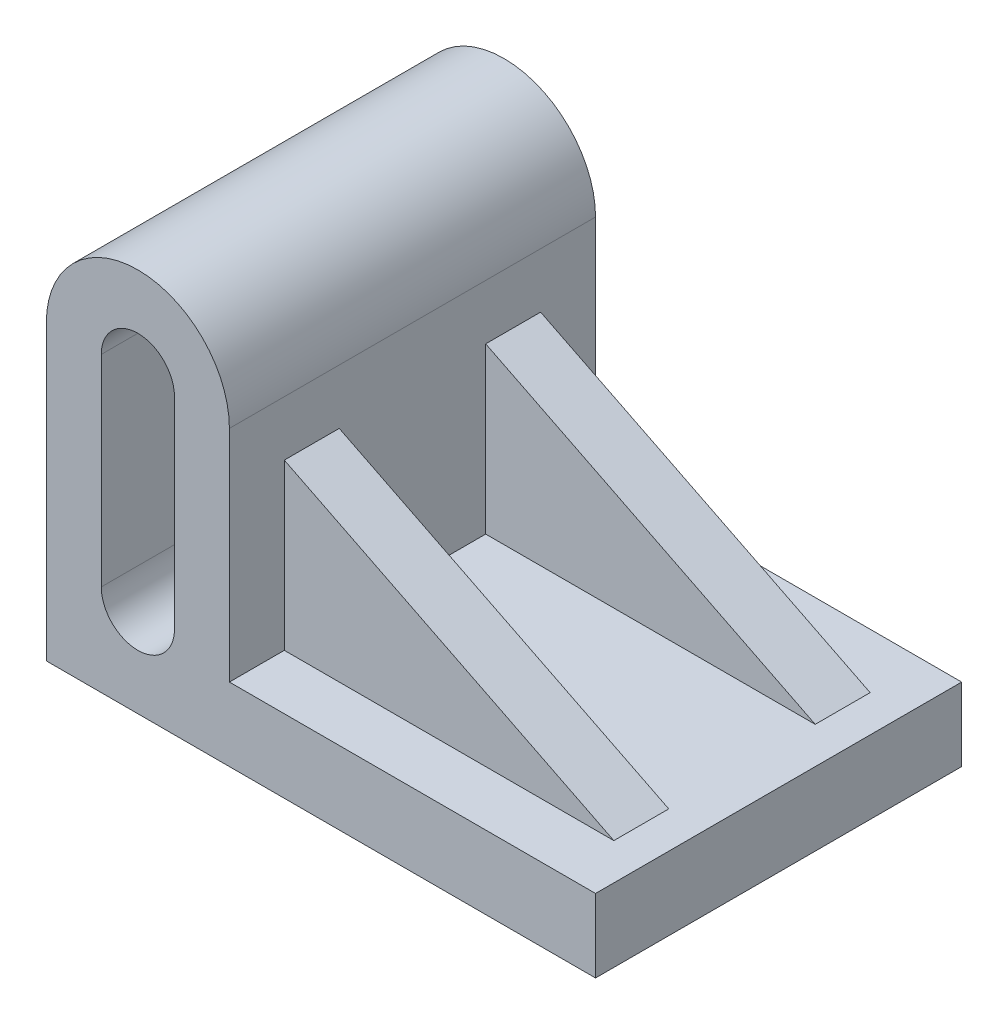
ISO-10303-21;
HEADER;
FILE_DESCRIPTION(('STEP AP214'),'2;1');
FILE_NAME('part.step','',(''),(''),'','','');
FILE_SCHEMA(('AUTOMOTIVE_DESIGN { 1 0 10303 214 1 1 1 1 }'));
ENDSEC;
DATA;
#1=APPLICATION_CONTEXT('core data for automotive mechanical design processes');
#2=APPLICATION_PROTOCOL_DEFINITION('international standard','automotive_design',2000,#1);
#3=PRODUCT_CONTEXT('',#1,'mechanical');
#4=PRODUCT('Part','Part','',(#3));
#5=PRODUCT_RELATED_PRODUCT_CATEGORY('part','',(#4));
#6=PRODUCT_DEFINITION_FORMATION('','',#4);
#7=PRODUCT_DEFINITION_CONTEXT('part definition',#1,'design');
#8=PRODUCT_DEFINITION('design','',#6,#7);
#9=PRODUCT_DEFINITION_SHAPE('','',#8);
#10=(LENGTH_UNIT() NAMED_UNIT(*) SI_UNIT(.MILLI.,.METRE.));
#11=(NAMED_UNIT(*) PLANE_ANGLE_UNIT() SI_UNIT($,.RADIAN.));
#12=(NAMED_UNIT(*) SI_UNIT($,.STERADIAN.) SOLID_ANGLE_UNIT());
#13=UNCERTAINTY_MEASURE_WITH_UNIT(LENGTH_MEASURE(1.E-05),#10,'distance_accuracy_value','');
#14=(GEOMETRIC_REPRESENTATION_CONTEXT(3) GLOBAL_UNCERTAINTY_ASSIGNED_CONTEXT((#13)) GLOBAL_UNIT_ASSIGNED_CONTEXT((#10,
#11,#12)) REPRESENTATION_CONTEXT('',''));
#15=CARTESIAN_POINT('',(0.,0.,0.));
#16=DIRECTION('',(0.,0.,1.));
#17=DIRECTION('',(1.,0.,0.));
#18=AXIS2_PLACEMENT_3D('',#15,#16,#17);
#19=CARTESIAN_POINT('',(0.,-20.,100.));
#20=DIRECTION('',(0.,1.,0.));
#21=DIRECTION('',(0.,0.,1.));
#22=AXIS2_PLACEMENT_3D('',#19,#20,#21);
#23=PLANE('',#22);
#24=DIRECTION('',(1.,0.,0.));
#25=VECTOR('',#24,1.);
#26=CARTESIAN_POINT('',(0.,-20.,70.));
#27=LINE('',#26,#25);
#28=CARTESIAN_POINT('',(-25.,-20.,70.));
#29=VERTEX_POINT('',#28);
#30=CARTESIAN_POINT('',(65.,-20.,70.));
#31=VERTEX_POINT('',#30);
#32=EDGE_CURVE('E355',#29,#31,#27,.T.);
#33=ORIENTED_EDGE('',*,*,#32,.T.);
#34=DIRECTION('',(0.,0.,1.));
#35=VECTOR('',#34,1.);
#36=CARTESIAN_POINT('',(65.,-20.,0.));
#37=LINE('',#36,#35);
#38=CARTESIAN_POINT('',(65.,-20.,85.));
#39=VERTEX_POINT('',#38);
#40=EDGE_CURVE('E173',#31,#39,#37,.T.);
#41=ORIENTED_EDGE('',*,*,#40,.T.);
#42=DIRECTION('',(1.,0.,0.));
#43=VECTOR('',#42,1.);
#44=CARTESIAN_POINT('',(0.,-20.,85.));
#45=LINE('',#44,#43);
#46=CARTESIAN_POINT('',(-25.,-20.,85.));
#47=VERTEX_POINT('',#46);
#48=EDGE_CURVE('E179',#47,#39,#45,.T.);
#49=ORIENTED_EDGE('',*,*,#48,.F.);
#50=DIRECTION('',(0.,0.,-1.));
#51=VECTOR('',#50,1.);
#52=CARTESIAN_POINT('',(-25.,-20.,100.));
#53=LINE('',#52,#51);
#54=CARTESIAN_POINT('',(-25.,-20.,100.));
#55=VERTEX_POINT('',#54);
#56=EDGE_CURVE('E11',#55,#47,#53,.T.);
#57=ORIENTED_EDGE('',*,*,#56,.F.);
#58=DIRECTION('',(1.,0.,0.));
#59=VECTOR('',#58,1.);
#60=CARTESIAN_POINT('',(0.,-20.,100.));
#61=LINE('',#60,#59);
#62=CARTESIAN_POINT('',(75.,-20.,100.));
#63=VERTEX_POINT('',#62);
#64=EDGE_CURVE('E209',#55,#63,#61,.T.);
#65=ORIENTED_EDGE('',*,*,#64,.T.);
#66=DIRECTION('',(0.,0.,-1.));
#67=VECTOR('',#66,1.);
#68=CARTESIAN_POINT('',(75.,-20.,100.));
#69=LINE('',#68,#67);
#70=CARTESIAN_POINT('',(75.,-20.,0.));
#71=VERTEX_POINT('',#70);
#72=EDGE_CURVE('E268',#63,#71,#69,.T.);
#73=ORIENTED_EDGE('',*,*,#72,.T.);
#74=DIRECTION('',(1.,0.,0.));
#75=VECTOR('',#74,1.);
#76=CARTESIAN_POINT('',(0.,-20.,0.));
#77=LINE('',#76,#75);
#78=CARTESIAN_POINT('',(-25.,-20.,0.));
#79=VERTEX_POINT('',#78);
#80=EDGE_CURVE('E247',#79,#71,#77,.T.);
#81=ORIENTED_EDGE('',*,*,#80,.F.);
#82=CARTESIAN_POINT('',(-25.,-20.,15.));
#83=VERTEX_POINT('',#82);
#84=EDGE_CURVE('E57',#83,#79,#53,.T.);
#85=ORIENTED_EDGE('',*,*,#84,.F.);
#86=DIRECTION('',(1.,0.,0.));
#87=VECTOR('',#86,1.);
#88=CARTESIAN_POINT('',(0.,-20.,15.));
#89=LINE('',#88,#87);
#90=CARTESIAN_POINT('',(65.,-20.,15.));
#91=VERTEX_POINT('',#90);
#92=EDGE_CURVE('E377',#83,#91,#89,.T.);
#93=ORIENTED_EDGE('',*,*,#92,.T.);
#94=DIRECTION('',(0.,0.,1.));
#95=VECTOR('',#94,1.);
#96=CARTESIAN_POINT('',(65.,-20.,0.));
#97=LINE('',#96,#95);
#98=CARTESIAN_POINT('',(65.,-20.,30.));
#99=VERTEX_POINT('',#98);
#100=EDGE_CURVE('E371',#91,#99,#97,.T.);
#101=ORIENTED_EDGE('',*,*,#100,.T.);
#102=DIRECTION('',(1.,0.,0.));
#103=VECTOR('',#102,1.);
#104=CARTESIAN_POINT('',(0.,-20.,30.));
#105=LINE('',#104,#103);
#106=CARTESIAN_POINT('',(-25.,-20.,30.));
#107=VERTEX_POINT('',#106);
#108=EDGE_CURVE('E352',#107,#99,#105,.T.);
#109=ORIENTED_EDGE('',*,*,#108,.F.);
#110=EDGE_CURVE('E55',#29,#107,#53,.T.);
#111=ORIENTED_EDGE('',*,*,#110,.F.);
#112=EDGE_LOOP('',(#33,#41,#49,#57,#65,#73,#81,#85,#93,#101,#109,#111));
#113=FACE_BOUND('',#112,.T.);
#114=ADVANCED_FACE('F45',(#113),#23,.T.);
#115=CARTESIAN_POINT('',(-25.,0.,100.));
#116=DIRECTION('',(1.,0.,0.));
#117=DIRECTION('',(0.,0.,-1.));
#118=AXIS2_PLACEMENT_3D('',#115,#116,#117);
#119=PLANE('',#118);
#120=ORIENTED_EDGE('',*,*,#84,.T.);
#121=DIRECTION('',(0.,-1.,0.));
#122=VECTOR('',#121,1.);
#123=CARTESIAN_POINT('',(-25.,0.,0.));
#124=LINE('',#123,#122);
#125=CARTESIAN_POINT('',(-25.,40.,0.));
#126=VERTEX_POINT('',#125);
#127=EDGE_CURVE('E250',#126,#79,#124,.T.);
#128=ORIENTED_EDGE('',*,*,#127,.F.);
#129=DIRECTION('',(0.,0.,-1.));
#130=VECTOR('',#129,1.);
#131=CARTESIAN_POINT('',(-25.,40.,100.));
#132=LINE('',#131,#130);
#133=CARTESIAN_POINT('',(-25.,40.,100.));
#134=VERTEX_POINT('',#133);
#135=EDGE_CURVE('E283',#134,#126,#132,.T.);
#136=ORIENTED_EDGE('',*,*,#135,.F.);
#137=DIRECTION('',(0.,-1.,0.));
#138=VECTOR('',#137,1.);
#139=CARTESIAN_POINT('',(-25.,0.,100.));
#140=LINE('',#139,#138);
#141=EDGE_CURVE('E213',#134,#55,#140,.T.);
#142=ORIENTED_EDGE('',*,*,#141,.T.);
#143=ORIENTED_EDGE('',*,*,#56,.T.);
#144=DIRECTION('',(0.,-1.,0.));
#145=VECTOR('',#144,1.);
#146=CARTESIAN_POINT('',(-25.,25.,85.));
#147=LINE('',#146,#145);
#148=CARTESIAN_POINT('',(-25.,25.,85.));
#149=VERTEX_POINT('',#148);
#150=EDGE_CURVE('E172',#149,#47,#147,.T.);
#151=ORIENTED_EDGE('',*,*,#150,.F.);
#152=DIRECTION('',(0.,0.,1.));
#153=VECTOR('',#152,1.);
#154=CARTESIAN_POINT('',(-25.,25.,0.));
#155=LINE('',#154,#153);
#156=CARTESIAN_POINT('',(-25.,25.,70.));
#157=VERTEX_POINT('',#156);
#158=EDGE_CURVE('E162',#157,#149,#155,.T.);
#159=ORIENTED_EDGE('',*,*,#158,.F.);
#160=DIRECTION('',(0.,-1.,0.));
#161=VECTOR('',#160,1.);
#162=CARTESIAN_POINT('',(-25.,25.,70.));
#163=LINE('',#162,#161);
#164=EDGE_CURVE('E185',#157,#29,#163,.T.);
#165=ORIENTED_EDGE('',*,*,#164,.T.);
#166=ORIENTED_EDGE('',*,*,#110,.T.);
#167=DIRECTION('',(0.,-1.,0.));
#168=VECTOR('',#167,1.);
#169=CARTESIAN_POINT('',(-25.,25.,30.));
#170=LINE('',#169,#168);
#171=CARTESIAN_POINT('',(-25.,25.,30.));
#172=VERTEX_POINT('',#171);
#173=EDGE_CURVE('E346',#172,#107,#170,.T.);
#174=ORIENTED_EDGE('',*,*,#173,.F.);
#175=DIRECTION('',(0.,0.,1.));
#176=VECTOR('',#175,1.);
#177=CARTESIAN_POINT('',(-25.,25.,0.));
#178=LINE('',#177,#176);
#179=CARTESIAN_POINT('',(-25.,25.,15.));
#180=VERTEX_POINT('',#179);
#181=EDGE_CURVE('E360',#180,#172,#178,.T.);
#182=ORIENTED_EDGE('',*,*,#181,.F.);
#183=DIRECTION('',(0.,-1.,0.));
#184=VECTOR('',#183,1.);
#185=CARTESIAN_POINT('',(-25.,25.,15.));
#186=LINE('',#185,#184);
#187=EDGE_CURVE('E71',#180,#83,#186,.T.);
#188=ORIENTED_EDGE('',*,*,#187,.T.);
#189=EDGE_LOOP('',(#120,#128,#136,#142,#143,#151,#159,#165,#166,#174,#182,#188));
#190=FACE_BOUND('',#189,.T.);
#191=ADVANCED_FACE('F182',(#190),#119,.T.);
#192=CARTESIAN_POINT('',(-50.,40.,100.));
#193=DIRECTION('',(0.,0.,-1.));
#194=DIRECTION('',(-1.,0.,0.));
#195=AXIS2_PLACEMENT_3D('',#192,#193,#194);
#196=CYLINDRICAL_SURFACE('',#195,25.);
#197=CARTESIAN_POINT('',(-50.,40.,0.));
#198=DIRECTION('',(0.,0.,1.));
#199=DIRECTION('',(1.,0.,0.));
#200=AXIS2_PLACEMENT_3D('',#197,#198,#199);
#201=CIRCLE('',#200,25.);
#202=CARTESIAN_POINT('',(-75.,40.,0.));
#203=VERTEX_POINT('',#202);
#204=EDGE_CURVE('E253',#126,#203,#201,.T.);
#205=ORIENTED_EDGE('',*,*,#204,.T.);
#206=DIRECTION('',(0.,0.,-1.));
#207=VECTOR('',#206,1.);
#208=CARTESIAN_POINT('',(-75.,40.,100.));
#209=LINE('',#208,#207);
#210=CARTESIAN_POINT('',(-75.,40.,100.));
#211=VERTEX_POINT('',#210);
#212=EDGE_CURVE('E279',#211,#203,#209,.T.);
#213=ORIENTED_EDGE('',*,*,#212,.F.);
#214=CARTESIAN_POINT('',(-50.,40.,100.));
#215=DIRECTION('',(0.,0.,1.));
#216=DIRECTION('',(1.,0.,0.));
#217=AXIS2_PLACEMENT_3D('',#214,#215,#216);
#218=CIRCLE('',#217,25.);
#219=EDGE_CURVE('E216',#134,#211,#218,.T.);
#220=ORIENTED_EDGE('',*,*,#219,.F.);
#221=ORIENTED_EDGE('',*,*,#135,.T.);
#222=EDGE_LOOP('',(#205,#213,#220,#221));
#223=FACE_BOUND('',#222,.T.);
#224=ADVANCED_FACE('F327',(#223),#196,.T.);
#225=CARTESIAN_POINT('',(-75.,0.,100.));
#226=DIRECTION('',(1.,0.,0.));
#227=DIRECTION('',(0.,1.,0.));
#228=AXIS2_PLACEMENT_3D('',#225,#226,#227);
#229=PLANE('',#228);
#230=DIRECTION('',(0.,-1.,0.));
#231=VECTOR('',#230,1.);
#232=CARTESIAN_POINT('',(-75.,0.,0.));
#233=LINE('',#232,#231);
#234=CARTESIAN_POINT('',(-75.,-40.,0.));
#235=VERTEX_POINT('',#234);
#236=EDGE_CURVE('E257',#203,#235,#233,.T.);
#237=ORIENTED_EDGE('',*,*,#236,.T.);
#238=DIRECTION('',(0.,0.,-1.));
#239=VECTOR('',#238,1.);
#240=CARTESIAN_POINT('',(-75.,-40.,100.));
#241=LINE('',#240,#239);
#242=CARTESIAN_POINT('',(-75.,-40.,100.));
#243=VERTEX_POINT('',#242);
#244=EDGE_CURVE('E275',#243,#235,#241,.T.);
#245=ORIENTED_EDGE('',*,*,#244,.F.);
#246=DIRECTION('',(0.,-1.,0.));
#247=VECTOR('',#246,1.);
#248=CARTESIAN_POINT('',(-75.,0.,100.));
#249=LINE('',#248,#247);
#250=EDGE_CURVE('E220',#211,#243,#249,.T.);
#251=ORIENTED_EDGE('',*,*,#250,.F.);
#252=ORIENTED_EDGE('',*,*,#212,.T.);
#253=EDGE_LOOP('',(#237,#245,#251,#252));
#254=FACE_BOUND('',#253,.T.);
#255=ADVANCED_FACE('F331',(#254),#229,.F.);
#256=CARTESIAN_POINT('',(0.,-40.,100.));
#257=DIRECTION('',(0.,1.,0.));
#258=DIRECTION('',(0.,0.,1.));
#259=AXIS2_PLACEMENT_3D('',#256,#257,#258);
#260=PLANE('',#259);
#261=DIRECTION('',(1.,0.,0.));
#262=VECTOR('',#261,1.);
#263=CARTESIAN_POINT('',(0.,-40.,0.));
#264=LINE('',#263,#262);
#265=CARTESIAN_POINT('',(75.,-40.,0.));
#266=VERTEX_POINT('',#265);
#267=EDGE_CURVE('E261',#235,#266,#264,.T.);
#268=ORIENTED_EDGE('',*,*,#267,.T.);
#269=DIRECTION('',(0.,0.,-1.));
#270=VECTOR('',#269,1.);
#271=CARTESIAN_POINT('',(75.,-40.,100.));
#272=LINE('',#271,#270);
#273=CARTESIAN_POINT('',(75.,-40.,100.));
#274=VERTEX_POINT('',#273);
#275=EDGE_CURVE('E272',#274,#266,#272,.T.);
#276=ORIENTED_EDGE('',*,*,#275,.F.);
#277=DIRECTION('',(1.,0.,0.));
#278=VECTOR('',#277,1.);
#279=CARTESIAN_POINT('',(0.,-40.,100.));
#280=LINE('',#279,#278);
#281=EDGE_CURVE('E224',#243,#274,#280,.T.);
#282=ORIENTED_EDGE('',*,*,#281,.F.);
#283=ORIENTED_EDGE('',*,*,#244,.T.);
#284=EDGE_LOOP('',(#268,#276,#282,#283));
#285=FACE_BOUND('',#284,.T.);
#286=ADVANCED_FACE('F333',(#285),#260,.F.);
#287=CARTESIAN_POINT('',(-60.,0.,100.));
#288=DIRECTION('',(1.,0.,0.));
#289=DIRECTION('',(0.,0.,-1.));
#290=AXIS2_PLACEMENT_3D('',#287,#288,#289);
#291=PLANE('',#290);
#292=DIRECTION('',(0.,-1.,0.));
#293=VECTOR('',#292,1.);
#294=CARTESIAN_POINT('',(-60.,0.,0.));
#295=LINE('',#294,#293);
#296=CARTESIAN_POINT('',(-60.,40.,0.));
#297=VERTEX_POINT('',#296);
#298=CARTESIAN_POINT('',(-60.,-15.,0.));
#299=VERTEX_POINT('',#298);
#300=EDGE_CURVE('E188',#297,#299,#295,.T.);
#301=ORIENTED_EDGE('',*,*,#300,.F.);
#302=DIRECTION('',(0.,0.,-1.));
#303=VECTOR('',#302,1.);
#304=CARTESIAN_POINT('',(-60.,40.,100.));
#305=LINE('',#304,#303);
#306=CARTESIAN_POINT('',(-60.,40.,100.));
#307=VERTEX_POINT('',#306);
#308=EDGE_CURVE('E49',#307,#297,#305,.T.);
#309=ORIENTED_EDGE('',*,*,#308,.F.);
#310=DIRECTION('',(0.,-1.,0.));
#311=VECTOR('',#310,1.);
#312=CARTESIAN_POINT('',(-60.,0.,100.));
#313=LINE('',#312,#311);
#314=CARTESIAN_POINT('',(-60.,-15.,100.));
#315=VERTEX_POINT('',#314);
#316=EDGE_CURVE('E193',#307,#315,#313,.T.);
#317=ORIENTED_EDGE('',*,*,#316,.T.);
#318=DIRECTION('',(0.,0.,-1.));
#319=VECTOR('',#318,1.);
#320=CARTESIAN_POINT('',(-60.,-15.,100.));
#321=LINE('',#320,#319);
#322=EDGE_CURVE('E231',#315,#299,#321,.T.);
#323=ORIENTED_EDGE('',*,*,#322,.T.);
#324=EDGE_LOOP('',(#301,#309,#317,#323));
#325=FACE_BOUND('',#324,.T.);
#326=ADVANCED_FACE('F47',(#325),#291,.T.);
#327=CARTESIAN_POINT('',(-50.,40.,100.));
#328=DIRECTION('',(0.,0.,-1.));
#329=DIRECTION('',(-1.,0.,0.));
#330=AXIS2_PLACEMENT_3D('',#327,#328,#329);
#331=CYLINDRICAL_SURFACE('',#330,10.);
#332=CARTESIAN_POINT('',(-50.,40.,0.));
#333=DIRECTION('',(0.,0.,1.));
#334=DIRECTION('',(1.,0.,0.));
#335=AXIS2_PLACEMENT_3D('',#332,#333,#334);
#336=CIRCLE('',#335,10.);
#337=CARTESIAN_POINT('',(-40.,40.,0.));
#338=VERTEX_POINT('',#337);
#339=EDGE_CURVE('E235',#338,#297,#336,.T.);
#340=ORIENTED_EDGE('',*,*,#339,.F.);
#341=DIRECTION('',(0.,0.,-1.));
#342=VECTOR('',#341,1.);
#343=CARTESIAN_POINT('',(-40.,40.,100.));
#344=LINE('',#343,#342);
#345=CARTESIAN_POINT('',(-40.,40.,100.));
#346=VERTEX_POINT('',#345);
#347=EDGE_CURVE('E290',#346,#338,#344,.T.);
#348=ORIENTED_EDGE('',*,*,#347,.F.);
#349=CARTESIAN_POINT('',(-50.,40.,100.));
#350=DIRECTION('',(0.,0.,1.));
#351=DIRECTION('',(1.,0.,0.));
#352=AXIS2_PLACEMENT_3D('',#349,#350,#351);
#353=CIRCLE('',#352,10.);
#354=EDGE_CURVE('E197',#346,#307,#353,.T.);
#355=ORIENTED_EDGE('',*,*,#354,.T.);
#356=ORIENTED_EDGE('',*,*,#308,.T.);
#357=EDGE_LOOP('',(#340,#348,#355,#356));
#358=FACE_BOUND('',#357,.T.);
#359=ADVANCED_FACE('F299',(#358),#331,.F.);
#360=CARTESIAN_POINT('',(-40.,0.,100.));
#361=DIRECTION('',(1.,0.,0.));
#362=DIRECTION('',(0.,1.,0.));
#363=AXIS2_PLACEMENT_3D('',#360,#361,#362);
#364=PLANE('',#363);
#365=DIRECTION('',(0.,-1.,0.));
#366=VECTOR('',#365,1.);
#367=CARTESIAN_POINT('',(-40.,0.,0.));
#368=LINE('',#367,#366);
#369=CARTESIAN_POINT('',(-40.,-15.,0.));
#370=VERTEX_POINT('',#369);
#371=EDGE_CURVE('E239',#338,#370,#368,.T.);
#372=ORIENTED_EDGE('',*,*,#371,.T.);
#373=DIRECTION('',(0.,0.,-1.));
#374=VECTOR('',#373,1.);
#375=CARTESIAN_POINT('',(-40.,-15.,100.));
#376=LINE('',#375,#374);
#377=CARTESIAN_POINT('',(-40.,-15.,100.));
#378=VERTEX_POINT('',#377);
#379=EDGE_CURVE('E288',#378,#370,#376,.T.);
#380=ORIENTED_EDGE('',*,*,#379,.F.);
#381=DIRECTION('',(0.,-1.,0.));
#382=VECTOR('',#381,1.);
#383=CARTESIAN_POINT('',(-40.,0.,100.));
#384=LINE('',#383,#382);
#385=EDGE_CURVE('E202',#346,#378,#384,.T.);
#386=ORIENTED_EDGE('',*,*,#385,.F.);
#387=ORIENTED_EDGE('',*,*,#347,.T.);
#388=EDGE_LOOP('',(#372,#380,#386,#387));
#389=FACE_BOUND('',#388,.T.);
#390=ADVANCED_FACE('F308',(#389),#364,.F.);
#391=CARTESIAN_POINT('',(-50.,-15.,100.));
#392=DIRECTION('',(0.,0.,-1.));
#393=DIRECTION('',(-1.,0.,0.));
#394=AXIS2_PLACEMENT_3D('',#391,#392,#393);
#395=CYLINDRICAL_SURFACE('',#394,10.);
#396=CARTESIAN_POINT('',(-50.,-15.,0.));
#397=DIRECTION('',(0.,0.,1.));
#398=DIRECTION('',(1.,0.,0.));
#399=AXIS2_PLACEMENT_3D('',#396,#397,#398);
#400=CIRCLE('',#399,10.);
#401=EDGE_CURVE('E243',#299,#370,#400,.T.);
#402=ORIENTED_EDGE('',*,*,#401,.F.);
#403=ORIENTED_EDGE('',*,*,#322,.F.);
#404=CARTESIAN_POINT('',(-50.,-15.,100.));
#405=DIRECTION('',(0.,0.,1.));
#406=DIRECTION('',(1.,0.,0.));
#407=AXIS2_PLACEMENT_3D('',#404,#405,#406);
#408=CIRCLE('',#407,10.);
#409=EDGE_CURVE('E205',#315,#378,#408,.T.);
#410=ORIENTED_EDGE('',*,*,#409,.T.);
#411=ORIENTED_EDGE('',*,*,#379,.T.);
#412=EDGE_LOOP('',(#402,#403,#410,#411));
#413=FACE_BOUND('',#412,.T.);
#414=ADVANCED_FACE('F311',(#413),#395,.F.);
#415=CARTESIAN_POINT('',(75.,0.,100.));
#416=DIRECTION('',(1.,0.,0.));
#417=DIRECTION('',(0.,1.,0.));
#418=AXIS2_PLACEMENT_3D('',#415,#416,#417);
#419=PLANE('',#418);
#420=DIRECTION('',(0.,-1.,0.));
#421=VECTOR('',#420,1.);
#422=CARTESIAN_POINT('',(75.,0.,0.));
#423=LINE('',#422,#421);
#424=EDGE_CURVE('E198',#71,#266,#423,.T.);
#425=ORIENTED_EDGE('',*,*,#424,.F.);
#426=ORIENTED_EDGE('',*,*,#72,.F.);
#427=DIRECTION('',(0.,-1.,0.));
#428=VECTOR('',#427,1.);
#429=CARTESIAN_POINT('',(75.,0.,100.));
#430=LINE('',#429,#428);
#431=EDGE_CURVE('E227',#63,#274,#430,.T.);
#432=ORIENTED_EDGE('',*,*,#431,.T.);
#433=ORIENTED_EDGE('',*,*,#275,.T.);
#434=EDGE_LOOP('',(#425,#426,#432,#433));
#435=FACE_BOUND('',#434,.T.);
#436=ADVANCED_FACE('F316',(#435),#419,.T.);
#437=CARTESIAN_POINT('',(0.,0.,100.));
#438=DIRECTION('',(0.,0.,1.));
#439=DIRECTION('',(1.,0.,0.));
#440=AXIS2_PLACEMENT_3D('',#437,#438,#439);
#441=PLANE('',#440);
#442=ORIENTED_EDGE('',*,*,#316,.F.);
#443=ORIENTED_EDGE('',*,*,#354,.F.);
#444=ORIENTED_EDGE('',*,*,#385,.T.);
#445=ORIENTED_EDGE('',*,*,#409,.F.);
#446=EDGE_LOOP('',(#442,#443,#444,#445));
#447=FACE_BOUND('',#446,.T.);
#448=ORIENTED_EDGE('',*,*,#64,.F.);
#449=ORIENTED_EDGE('',*,*,#141,.F.);
#450=ORIENTED_EDGE('',*,*,#219,.T.);
#451=ORIENTED_EDGE('',*,*,#250,.T.);
#452=ORIENTED_EDGE('',*,*,#281,.T.);
#453=ORIENTED_EDGE('',*,*,#431,.F.);
#454=EDGE_LOOP('',(#448,#449,#450,#451,#452,#453));
#455=FACE_BOUND('',#454,.T.);
#456=ADVANCED_FACE('F313',(#447,#455),#441,.T.);
#457=CARTESIAN_POINT('',(0.,0.,0.));
#458=DIRECTION('',(0.,0.,1.));
#459=DIRECTION('',(1.,0.,0.));
#460=AXIS2_PLACEMENT_3D('',#457,#458,#459);
#461=PLANE('',#460);
#462=ORIENTED_EDGE('',*,*,#300,.T.);
#463=ORIENTED_EDGE('',*,*,#401,.T.);
#464=ORIENTED_EDGE('',*,*,#371,.F.);
#465=ORIENTED_EDGE('',*,*,#339,.T.);
#466=EDGE_LOOP('',(#462,#463,#464,#465));
#467=FACE_BOUND('',#466,.T.);
#468=ORIENTED_EDGE('',*,*,#80,.T.);
#469=ORIENTED_EDGE('',*,*,#424,.T.);
#470=ORIENTED_EDGE('',*,*,#267,.F.);
#471=ORIENTED_EDGE('',*,*,#236,.F.);
#472=ORIENTED_EDGE('',*,*,#204,.F.);
#473=ORIENTED_EDGE('',*,*,#127,.T.);
#474=EDGE_LOOP('',(#468,#469,#470,#471,#472,#473));
#475=FACE_BOUND('',#474,.T.);
#476=ADVANCED_FACE('F305',(#467,#475),#461,.F.);
#477=CARTESIAN_POINT('',(0.,25.,70.));
#478=DIRECTION('',(0.,0.,-1.));
#479=DIRECTION('',(-1.,0.,0.));
#480=AXIS2_PLACEMENT_3D('',#477,#478,#479);
#481=PLANE('',#480);
#482=DIRECTION('',(-0.894427190999916,0.447213595499958,0.));
#483=VECTOR('',#482,1.);
#484=CARTESIAN_POINT('',(-4.99999999999998,15.,70.));
#485=LINE('',#484,#483);
#486=EDGE_CURVE('E168',#31,#157,#485,.T.);
#487=ORIENTED_EDGE('',*,*,#486,.F.);
#488=ORIENTED_EDGE('',*,*,#32,.F.);
#489=ORIENTED_EDGE('',*,*,#164,.F.);
#490=EDGE_LOOP('',(#487,#488,#489));
#491=FACE_BOUND('',#490,.T.);
#492=ADVANCED_FACE('F366',(#491),#481,.T.);
#493=CARTESIAN_POINT('',(0.,25.,85.));
#494=DIRECTION('',(0.,0.,-1.));
#495=DIRECTION('',(-1.,0.,0.));
#496=AXIS2_PLACEMENT_3D('',#493,#494,#495);
#497=PLANE('',#496);
#498=ORIENTED_EDGE('',*,*,#48,.T.);
#499=DIRECTION('',(0.894427190999916,-0.447213595499958,0.));
#500=VECTOR('',#499,1.);
#501=CARTESIAN_POINT('',(5.00000000000001,10.,85.));
#502=LINE('',#501,#500);
#503=EDGE_CURVE('E165',#149,#39,#502,.T.);
#504=ORIENTED_EDGE('',*,*,#503,.F.);
#505=ORIENTED_EDGE('',*,*,#150,.T.);
#506=EDGE_LOOP('',(#498,#504,#505));
#507=FACE_BOUND('',#506,.T.);
#508=ADVANCED_FACE('F178',(#507),#497,.F.);
#509=CARTESIAN_POINT('',(0.,25.,30.));
#510=DIRECTION('',(0.,0.,-1.));
#511=DIRECTION('',(-1.,0.,0.));
#512=AXIS2_PLACEMENT_3D('',#509,#510,#511);
#513=PLANE('',#512);
#514=ORIENTED_EDGE('',*,*,#108,.T.);
#515=DIRECTION('',(-0.894427190999916,0.447213595499958,0.));
#516=VECTOR('',#515,1.);
#517=CARTESIAN_POINT('',(-4.99999999999999,15.,30.));
#518=LINE('',#517,#516);
#519=EDGE_CURVE('E353',#99,#172,#518,.T.);
#520=ORIENTED_EDGE('',*,*,#519,.T.);
#521=ORIENTED_EDGE('',*,*,#173,.T.);
#522=EDGE_LOOP('',(#514,#520,#521));
#523=FACE_BOUND('',#522,.T.);
#524=ADVANCED_FACE('F351',(#523),#513,.F.);
#525=CARTESIAN_POINT('',(0.,25.,15.));
#526=DIRECTION('',(0.,0.,-1.));
#527=DIRECTION('',(-1.,0.,0.));
#528=AXIS2_PLACEMENT_3D('',#525,#526,#527);
#529=PLANE('',#528);
#530=DIRECTION('',(-0.894427190999916,0.447213595499958,0.));
#531=VECTOR('',#530,1.);
#532=CARTESIAN_POINT('',(-4.99999999999999,15.,15.));
#533=LINE('',#532,#531);
#534=EDGE_CURVE('E64',#91,#180,#533,.T.);
#535=ORIENTED_EDGE('',*,*,#534,.F.);
#536=ORIENTED_EDGE('',*,*,#92,.F.);
#537=ORIENTED_EDGE('',*,*,#187,.F.);
#538=EDGE_LOOP('',(#535,#536,#537));
#539=FACE_BOUND('',#538,.T.);
#540=ADVANCED_FACE('F383',(#539),#529,.T.);
#541=CARTESIAN_POINT('',(5.00000000000001,10.,0.));
#542=DIRECTION('',(-0.447213595499958,-0.894427190999916,0.));
#543=DIRECTION('',(0.894427190999916,-0.447213595499958,0.));
#544=AXIS2_PLACEMENT_3D('',#541,#542,#543);
#545=PLANE('',#544);
#546=ORIENTED_EDGE('',*,*,#100,.F.);
#547=ORIENTED_EDGE('',*,*,#534,.T.);
#548=ORIENTED_EDGE('',*,*,#181,.T.);
#549=ORIENTED_EDGE('',*,*,#519,.F.);
#550=EDGE_LOOP('',(#546,#547,#548,#549));
#551=FACE_BOUND('',#550,.T.);
#552=ADVANCED_FACE('F386',(#551),#545,.F.);
#553=ORIENTED_EDGE('',*,*,#486,.T.);
#554=ORIENTED_EDGE('',*,*,#158,.T.);
#555=ORIENTED_EDGE('',*,*,#503,.T.);
#556=ORIENTED_EDGE('',*,*,#40,.F.);
#557=EDGE_LOOP('',(#553,#554,#555,#556));
#558=FACE_BOUND('',#557,.T.);
#559=ADVANCED_FACE('F164',(#558),#545,.F.);
#560=CLOSED_SHELL('',(#114,#191,#224,#255,#286,#326,#359,#390,#414,#436,#456,#476,#492,#508,
#524,#540,#552,#559));
#561=MANIFOLD_SOLID_BREP('B2',#560);
#562=ADVANCED_BREP_SHAPE_REPRESENTATION('',(#18,#561),#14);
#563=SHAPE_DEFINITION_REPRESENTATION(#9,#562);
ENDSEC;
END-ISO-10303-21;
